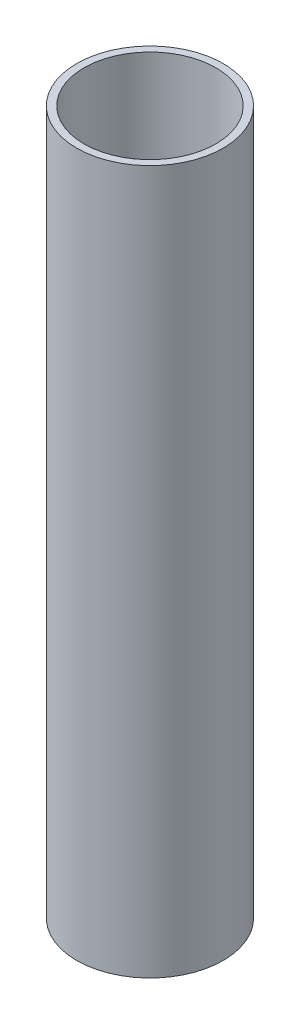
ISO-10303-21;
HEADER;
FILE_DESCRIPTION(('STEP AP214'),'2;1');
FILE_NAME('part.step','',(''),(''),'','','');
FILE_SCHEMA(('AUTOMOTIVE_DESIGN { 1 0 10303 214 1 1 1 1 }'));
ENDSEC;
DATA;
#1=APPLICATION_CONTEXT('core data for automotive mechanical design processes');
#2=APPLICATION_PROTOCOL_DEFINITION('international standard','automotive_design',2000,#1);
#3=PRODUCT_CONTEXT('',#1,'mechanical');
#4=PRODUCT('Part','Part','',(#3));
#5=PRODUCT_RELATED_PRODUCT_CATEGORY('part','',(#4));
#6=PRODUCT_DEFINITION_FORMATION('','',#4);
#7=PRODUCT_DEFINITION_CONTEXT('part definition',#1,'design');
#8=PRODUCT_DEFINITION('design','',#6,#7);
#9=PRODUCT_DEFINITION_SHAPE('','',#8);
#10=(LENGTH_UNIT() NAMED_UNIT(*) SI_UNIT(.MILLI.,.METRE.));
#11=(NAMED_UNIT(*) PLANE_ANGLE_UNIT() SI_UNIT($,.RADIAN.));
#12=(NAMED_UNIT(*) SI_UNIT($,.STERADIAN.) SOLID_ANGLE_UNIT());
#13=UNCERTAINTY_MEASURE_WITH_UNIT(LENGTH_MEASURE(1.E-05),#10,'distance_accuracy_value','');
#14=(GEOMETRIC_REPRESENTATION_CONTEXT(3) GLOBAL_UNCERTAINTY_ASSIGNED_CONTEXT((#13)) GLOBAL_UNIT_ASSIGNED_CONTEXT((#10,
#11,#12)) REPRESENTATION_CONTEXT('',''));
#15=CARTESIAN_POINT('',(0.,0.,0.));
#16=DIRECTION('',(0.,0.,1.));
#17=DIRECTION('',(1.,0.,0.));
#18=AXIS2_PLACEMENT_3D('',#15,#16,#17);
#19=CARTESIAN_POINT('',(0.,-304.8,0.));
#20=DIRECTION('',(0.,1.,0.));
#21=DIRECTION('',(0.,0.,1.));
#22=AXIS2_PLACEMENT_3D('',#19,#20,#21);
#23=CYLINDRICAL_SURFACE('',#22,31.75);
#24=CARTESIAN_POINT('',(0.,-304.8,0.));
#25=DIRECTION('',(0.,1.,0.));
#26=DIRECTION('',(0.,0.,1.));
#27=AXIS2_PLACEMENT_3D('',#24,#25,#26);
#28=CIRCLE('',#27,31.75);
#29=CARTESIAN_POINT('',(0.,-304.8,31.75));
#30=VERTEX_POINT('',#29);
#31=EDGE_CURVE('E10',#30,#30,#28,.T.);
#32=ORIENTED_EDGE('',*,*,#31,.T.);
#33=EDGE_LOOP('',(#32));
#34=FACE_BOUND('',#33,.T.);
#35=CARTESIAN_POINT('',(0.,0.,0.));
#36=DIRECTION('',(0.,1.,0.));
#37=DIRECTION('',(0.,0.,1.));
#38=AXIS2_PLACEMENT_3D('',#35,#36,#37);
#39=CIRCLE('',#38,31.75);
#40=CARTESIAN_POINT('',(0.,0.,31.75));
#41=VERTEX_POINT('',#40);
#42=EDGE_CURVE('E44',#41,#41,#39,.T.);
#43=ORIENTED_EDGE('',*,*,#42,.F.);
#44=EDGE_LOOP('',(#43));
#45=FACE_BOUND('',#44,.T.);
#46=ADVANCED_FACE('F41',(#34,#45),#23,.T.);
#47=CARTESIAN_POINT('',(0.,-304.8,0.));
#48=DIRECTION('',(0.,1.,0.));
#49=DIRECTION('',(0.,0.,1.));
#50=AXIS2_PLACEMENT_3D('',#47,#48,#49);
#51=PLANE('',#50);
#52=CARTESIAN_POINT('',(0.,-304.8,0.));
#53=DIRECTION('',(0.,1.,0.));
#54=DIRECTION('',(0.,0.,1.));
#55=AXIS2_PLACEMENT_3D('',#52,#53,#54);
#56=CIRCLE('',#55,28.575);
#57=CARTESIAN_POINT('',(0.,-304.8,28.575));
#58=VERTEX_POINT('',#57);
#59=EDGE_CURVE('E53',#58,#58,#56,.T.);
#60=ORIENTED_EDGE('',*,*,#59,.T.);
#61=EDGE_LOOP('',(#60));
#62=FACE_BOUND('',#61,.T.);
#63=ORIENTED_EDGE('',*,*,#31,.F.);
#64=EDGE_LOOP('',(#63));
#65=FACE_BOUND('',#64,.T.);
#66=ADVANCED_FACE('F63',(#62,#65),#51,.F.);
#67=CARTESIAN_POINT('',(0.,0.,0.));
#68=DIRECTION('',(0.,1.,0.));
#69=DIRECTION('',(0.,0.,1.));
#70=AXIS2_PLACEMENT_3D('',#67,#68,#69);
#71=PLANE('',#70);
#72=CARTESIAN_POINT('',(0.,0.,0.));
#73=DIRECTION('',(0.,1.,0.));
#74=DIRECTION('',(0.,0.,1.));
#75=AXIS2_PLACEMENT_3D('',#72,#73,#74);
#76=CIRCLE('',#75,28.575);
#77=CARTESIAN_POINT('',(0.,0.,28.575));
#78=VERTEX_POINT('',#77);
#79=EDGE_CURVE('E55',#78,#78,#76,.T.);
#80=ORIENTED_EDGE('',*,*,#79,.F.);
#81=EDGE_LOOP('',(#80));
#82=FACE_BOUND('',#81,.T.);
#83=ORIENTED_EDGE('',*,*,#42,.T.);
#84=EDGE_LOOP('',(#83));
#85=FACE_BOUND('',#84,.T.);
#86=ADVANCED_FACE('F69',(#82,#85),#71,.T.);
#87=CARTESIAN_POINT('',(0.,-304.8,0.));
#88=DIRECTION('',(0.,1.,0.));
#89=DIRECTION('',(0.,0.,1.));
#90=AXIS2_PLACEMENT_3D('',#87,#88,#89);
#91=CYLINDRICAL_SURFACE('',#90,28.575);
#92=ORIENTED_EDGE('',*,*,#59,.F.);
#93=EDGE_LOOP('',(#92));
#94=FACE_BOUND('',#93,.T.);
#95=ORIENTED_EDGE('',*,*,#79,.T.);
#96=EDGE_LOOP('',(#95));
#97=FACE_BOUND('',#96,.T.);
#98=ADVANCED_FACE('F66',(#94,#97),#91,.F.);
#99=CLOSED_SHELL('',(#46,#66,#86,#98));
#100=MANIFOLD_SOLID_BREP('B2',#99);
#101=ADVANCED_BREP_SHAPE_REPRESENTATION('',(#18,#100),#14);
#102=SHAPE_DEFINITION_REPRESENTATION(#9,#101);
ENDSEC;
END-ISO-10303-21;
